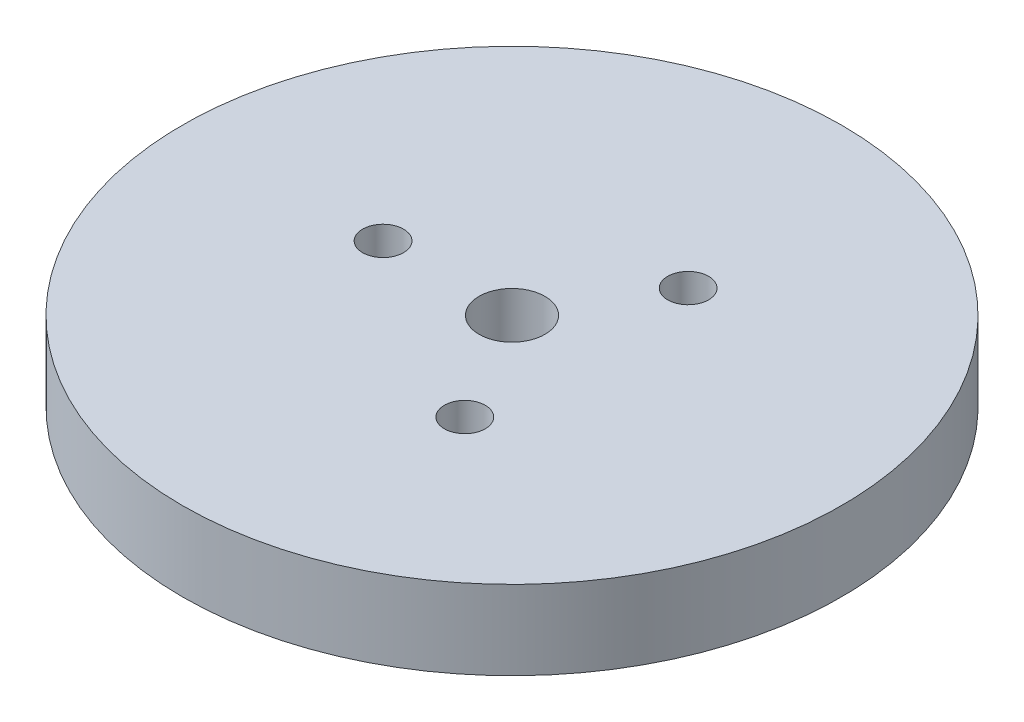
ISO-10303-21;
HEADER;
FILE_DESCRIPTION(('STEP AP214'),'2;1');
FILE_NAME('part.step','',(''),(''),'','','');
FILE_SCHEMA(('AUTOMOTIVE_DESIGN { 1 0 10303 214 1 1 1 1 }'));
ENDSEC;
DATA;
#1=APPLICATION_CONTEXT('core data for automotive mechanical design processes');
#2=APPLICATION_PROTOCOL_DEFINITION('international standard','automotive_design',2000,#1);
#3=PRODUCT_CONTEXT('',#1,'mechanical');
#4=PRODUCT('Part','Part','',(#3));
#5=PRODUCT_RELATED_PRODUCT_CATEGORY('part','',(#4));
#6=PRODUCT_DEFINITION_FORMATION('','',#4);
#7=PRODUCT_DEFINITION_CONTEXT('part definition',#1,'design');
#8=PRODUCT_DEFINITION('design','',#6,#7);
#9=PRODUCT_DEFINITION_SHAPE('','',#8);
#10=(LENGTH_UNIT() NAMED_UNIT(*) SI_UNIT(.MILLI.,.METRE.));
#11=(NAMED_UNIT(*) PLANE_ANGLE_UNIT() SI_UNIT($,.RADIAN.));
#12=(NAMED_UNIT(*) SI_UNIT($,.STERADIAN.) SOLID_ANGLE_UNIT());
#13=UNCERTAINTY_MEASURE_WITH_UNIT(LENGTH_MEASURE(1.E-05),#10,'distance_accuracy_value','');
#14=(GEOMETRIC_REPRESENTATION_CONTEXT(3) GLOBAL_UNCERTAINTY_ASSIGNED_CONTEXT((#13)) GLOBAL_UNIT_ASSIGNED_CONTEXT((#10,
#11,#12)) REPRESENTATION_CONTEXT('',''));
#15=CARTESIAN_POINT('',(0.,0.,0.));
#16=DIRECTION('',(0.,0.,1.));
#17=DIRECTION('',(1.,0.,0.));
#18=AXIS2_PLACEMENT_3D('',#15,#16,#17);
#19=CARTESIAN_POINT('',(0.,18.,0.));
#20=DIRECTION('',(0.,-1.,0.));
#21=DIRECTION('',(0.,0.,-1.));
#22=AXIS2_PLACEMENT_3D('',#19,#20,#21);
#23=CYLINDRICAL_SURFACE('',#22,75.);
#24=CARTESIAN_POINT('',(0.,18.,0.));
#25=DIRECTION('',(0.,1.,0.));
#26=DIRECTION('',(0.,0.,1.));
#27=AXIS2_PLACEMENT_3D('',#24,#25,#26);
#28=CIRCLE('',#27,75.);
#29=CARTESIAN_POINT('',(0.,18.,75.));
#30=VERTEX_POINT('',#29);
#31=EDGE_CURVE('E10',#30,#30,#28,.T.);
#32=ORIENTED_EDGE('',*,*,#31,.F.);
#33=EDGE_LOOP('',(#32));
#34=FACE_BOUND('',#33,.T.);
#35=CARTESIAN_POINT('',(0.,0.,0.));
#36=DIRECTION('',(0.,1.,0.));
#37=DIRECTION('',(0.,0.,1.));
#38=AXIS2_PLACEMENT_3D('',#35,#36,#37);
#39=CIRCLE('',#38,75.);
#40=CARTESIAN_POINT('',(0.,0.,75.));
#41=VERTEX_POINT('',#40);
#42=EDGE_CURVE('E37',#41,#41,#39,.T.);
#43=ORIENTED_EDGE('',*,*,#42,.T.);
#44=EDGE_LOOP('',(#43));
#45=FACE_BOUND('',#44,.T.);
#46=ADVANCED_FACE('F40',(#34,#45),#23,.T.);
#47=CARTESIAN_POINT('',(0.,18.,0.));
#48=DIRECTION('',(0.,1.,0.));
#49=DIRECTION('',(0.,0.,1.));
#50=AXIS2_PLACEMENT_3D('',#47,#48,#49);
#51=PLANE('',#50);
#52=CARTESIAN_POINT('',(14.6713478252819,18.,25.4115198489031));
#53=DIRECTION('',(0.,1.,0.));
#54=DIRECTION('',(0.866025403784436,0.,-0.500000000000004));
#55=AXIS2_PLACEMENT_3D('',#52,#53,#54);
#56=CIRCLE('',#55,4.65146481011212);
#57=CARTESIAN_POINT('',(18.6996345156483,18.,23.085787443847));
#58=VERTEX_POINT('',#57);
#59=EDGE_CURVE('E70',#58,#58,#56,.T.);
#60=ORIENTED_EDGE('',*,*,#59,.F.);
#61=EDGE_LOOP('',(#60));
#62=FACE_BOUND('',#61,.T.);
#63=CARTESIAN_POINT('',(14.6713478252815,18.,-25.4115198489033));
#64=DIRECTION('',(0.,1.,0.));
#65=DIRECTION('',(-0.866025403784443,0.,-0.499999999999992));
#66=AXIS2_PLACEMENT_3D('',#63,#64,#65);
#67=CIRCLE('',#66,4.65146481011212);
#68=CARTESIAN_POINT('',(10.643061134915,18.,-27.7372522539593));
#69=VERTEX_POINT('',#68);
#70=EDGE_CURVE('E61',#69,#69,#67,.T.);
#71=ORIENTED_EDGE('',*,*,#70,.F.);
#72=EDGE_LOOP('',(#71));
#73=FACE_BOUND('',#72,.T.);
#74=CARTESIAN_POINT('',(-29.3426956505635,18.,0.));
#75=DIRECTION('',(0.,1.,0.));
#76=DIRECTION('',(0.,0.,1.));
#77=AXIS2_PLACEMENT_3D('',#74,#75,#76);
#78=CIRCLE('',#77,4.65146481011212);
#79=CARTESIAN_POINT('',(-29.3426956505635,18.,4.65146481011212));
#80=VERTEX_POINT('',#79);
#81=EDGE_CURVE('E54',#80,#80,#78,.T.);
#82=ORIENTED_EDGE('',*,*,#81,.F.);
#83=EDGE_LOOP('',(#82));
#84=FACE_BOUND('',#83,.T.);
#85=CARTESIAN_POINT('',(0.,18.,0.));
#86=DIRECTION('',(0.,1.,0.));
#87=DIRECTION('',(0.,0.,1.));
#88=AXIS2_PLACEMENT_3D('',#85,#86,#87);
#89=CIRCLE('',#88,7.5);
#90=CARTESIAN_POINT('',(0.,18.,7.5));
#91=VERTEX_POINT('',#90);
#92=EDGE_CURVE('E50',#91,#91,#89,.T.);
#93=ORIENTED_EDGE('',*,*,#92,.F.);
#94=EDGE_LOOP('',(#93));
#95=FACE_BOUND('',#94,.T.);
#96=ORIENTED_EDGE('',*,*,#31,.T.);
#97=EDGE_LOOP('',(#96));
#98=FACE_BOUND('',#97,.T.);
#99=ADVANCED_FACE('F85',(#62,#73,#84,#95,#98),#51,.T.);
#100=CARTESIAN_POINT('',(0.,0.,0.));
#101=DIRECTION('',(0.,1.,0.));
#102=DIRECTION('',(0.,0.,1.));
#103=AXIS2_PLACEMENT_3D('',#100,#101,#102);
#104=PLANE('',#103);
#105=CARTESIAN_POINT('',(0.,0.,0.));
#106=DIRECTION('',(0.,1.,0.));
#107=DIRECTION('',(0.,0.,1.));
#108=AXIS2_PLACEMENT_3D('',#105,#106,#107);
#109=CIRCLE('',#108,7.5);
#110=CARTESIAN_POINT('',(0.,0.,7.5));
#111=VERTEX_POINT('',#110);
#112=EDGE_CURVE('E47',#111,#111,#109,.T.);
#113=ORIENTED_EDGE('',*,*,#112,.T.);
#114=EDGE_LOOP('',(#113));
#115=FACE_BOUND('',#114,.T.);
#116=ORIENTED_EDGE('',*,*,#42,.F.);
#117=EDGE_LOOP('',(#116));
#118=FACE_BOUND('',#117,.T.);
#119=ADVANCED_FACE('F84',(#115,#118),#104,.F.);
#120=CARTESIAN_POINT('',(0.,18.,0.));
#121=DIRECTION('',(0.,-1.,0.));
#122=DIRECTION('',(0.,0.,-1.));
#123=AXIS2_PLACEMENT_3D('',#120,#121,#122);
#124=CYLINDRICAL_SURFACE('',#123,7.5);
#125=ORIENTED_EDGE('',*,*,#92,.T.);
#126=EDGE_LOOP('',(#125));
#127=FACE_BOUND('',#126,.T.);
#128=ORIENTED_EDGE('',*,*,#112,.F.);
#129=EDGE_LOOP('',(#128));
#130=FACE_BOUND('',#129,.T.);
#131=ADVANCED_FACE('F91',(#127,#130),#124,.F.);
#132=CARTESIAN_POINT('',(-29.3426956505635,3.89684664166508,0.));
#133=DIRECTION('',(0.,1.,0.));
#134=DIRECTION('',(0.,0.,1.));
#135=AXIS2_PLACEMENT_3D('',#132,#133,#134);
#136=CYLINDRICAL_SURFACE('',#135,4.65146481011212);
#137=CARTESIAN_POINT('',(-29.3426956505635,3.89684664166508,0.));
#138=DIRECTION('',(0.,1.,0.));
#139=DIRECTION('',(0.,0.,1.));
#140=AXIS2_PLACEMENT_3D('',#137,#138,#139);
#141=CIRCLE('',#140,4.65146481011212);
#142=CARTESIAN_POINT('',(-29.3426956505635,3.89684664166508,4.65146481011212));
#143=VERTEX_POINT('',#142);
#144=EDGE_CURVE('E55',#143,#143,#141,.T.);
#145=ORIENTED_EDGE('',*,*,#144,.F.);
#146=EDGE_LOOP('',(#145));
#147=FACE_BOUND('',#146,.T.);
#148=ORIENTED_EDGE('',*,*,#81,.T.);
#149=EDGE_LOOP('',(#148));
#150=FACE_BOUND('',#149,.T.);
#151=ADVANCED_FACE('F96',(#147,#150),#136,.F.);
#152=CARTESIAN_POINT('',(-29.3426956505635,3.89684664166508,0.));
#153=DIRECTION('',(0.,1.,0.));
#154=DIRECTION('',(0.,0.,1.));
#155=AXIS2_PLACEMENT_3D('',#152,#153,#154);
#156=PLANE('',#155);
#157=ORIENTED_EDGE('',*,*,#144,.T.);
#158=EDGE_LOOP('',(#157));
#159=FACE_BOUND('',#158,.T.);
#160=ADVANCED_FACE('F127',(#159),#156,.T.);
#161=CARTESIAN_POINT('',(14.6713478252815,3.89684664166508,-25.4115198489033));
#162=DIRECTION('',(0.,1.,0.));
#163=DIRECTION('',(0.,0.,1.));
#164=AXIS2_PLACEMENT_3D('',#161,#162,#163);
#165=CYLINDRICAL_SURFACE('',#164,4.65146481011212);
#166=CARTESIAN_POINT('',(14.6713478252815,3.89684664166508,-25.4115198489033));
#167=DIRECTION('',(0.,1.,0.));
#168=DIRECTION('',(-0.866025403784443,0.,-0.499999999999992));
#169=AXIS2_PLACEMENT_3D('',#166,#167,#168);
#170=CIRCLE('',#169,4.65146481011212);
#171=CARTESIAN_POINT('',(10.643061134915,3.89684664166508,-27.7372522539593));
#172=VERTEX_POINT('',#171);
#173=EDGE_CURVE('E63',#172,#172,#170,.T.);
#174=ORIENTED_EDGE('',*,*,#173,.F.);
#175=EDGE_LOOP('',(#174));
#176=FACE_BOUND('',#175,.T.);
#177=ORIENTED_EDGE('',*,*,#70,.T.);
#178=EDGE_LOOP('',(#177));
#179=FACE_BOUND('',#178,.T.);
#180=ADVANCED_FACE('F133',(#176,#179),#165,.F.);
#181=CARTESIAN_POINT('',(14.6713478252815,3.89684664166508,-25.4115198489033));
#182=DIRECTION('',(0.,1.,0.));
#183=DIRECTION('',(-0.866025403784443,0.,-0.499999999999992));
#184=AXIS2_PLACEMENT_3D('',#181,#182,#183);
#185=PLANE('',#184);
#186=ORIENTED_EDGE('',*,*,#173,.T.);
#187=EDGE_LOOP('',(#186));
#188=FACE_BOUND('',#187,.T.);
#189=ADVANCED_FACE('F77',(#188),#185,.T.);
#190=CARTESIAN_POINT('',(14.6713478252819,3.89684664166508,25.4115198489031));
#191=DIRECTION('',(0.,1.,0.));
#192=DIRECTION('',(0.,0.,1.));
#193=AXIS2_PLACEMENT_3D('',#190,#191,#192);
#194=CYLINDRICAL_SURFACE('',#193,4.65146481011212);
#195=CARTESIAN_POINT('',(14.6713478252819,3.89684664166508,25.4115198489031));
#196=DIRECTION('',(0.,1.,0.));
#197=DIRECTION('',(0.866025403784436,0.,-0.500000000000004));
#198=AXIS2_PLACEMENT_3D('',#195,#196,#197);
#199=CIRCLE('',#198,4.65146481011212);
#200=CARTESIAN_POINT('',(18.6996345156483,3.89684664166508,23.085787443847));
#201=VERTEX_POINT('',#200);
#202=EDGE_CURVE('E59',#201,#201,#199,.T.);
#203=ORIENTED_EDGE('',*,*,#202,.F.);
#204=EDGE_LOOP('',(#203));
#205=FACE_BOUND('',#204,.T.);
#206=ORIENTED_EDGE('',*,*,#59,.T.);
#207=EDGE_LOOP('',(#206));
#208=FACE_BOUND('',#207,.T.);
#209=ADVANCED_FACE('F73',(#205,#208),#194,.F.);
#210=CARTESIAN_POINT('',(14.6713478252819,3.89684664166508,25.4115198489031));
#211=DIRECTION('',(0.,1.,0.));
#212=DIRECTION('',(0.866025403784436,0.,-0.500000000000004));
#213=AXIS2_PLACEMENT_3D('',#210,#211,#212);
#214=PLANE('',#213);
#215=ORIENTED_EDGE('',*,*,#202,.T.);
#216=EDGE_LOOP('',(#215));
#217=FACE_BOUND('',#216,.T.);
#218=ADVANCED_FACE('F71',(#217),#214,.T.);
#219=CLOSED_SHELL('',(#46,#99,#119,#131,#151,#160,#180,#189,#209,#218));
#220=MANIFOLD_SOLID_BREP('B2',#219);
#221=ADVANCED_BREP_SHAPE_REPRESENTATION('',(#18,#220),#14);
#222=SHAPE_DEFINITION_REPRESENTATION(#9,#221);
ENDSEC;
END-ISO-10303-21;
